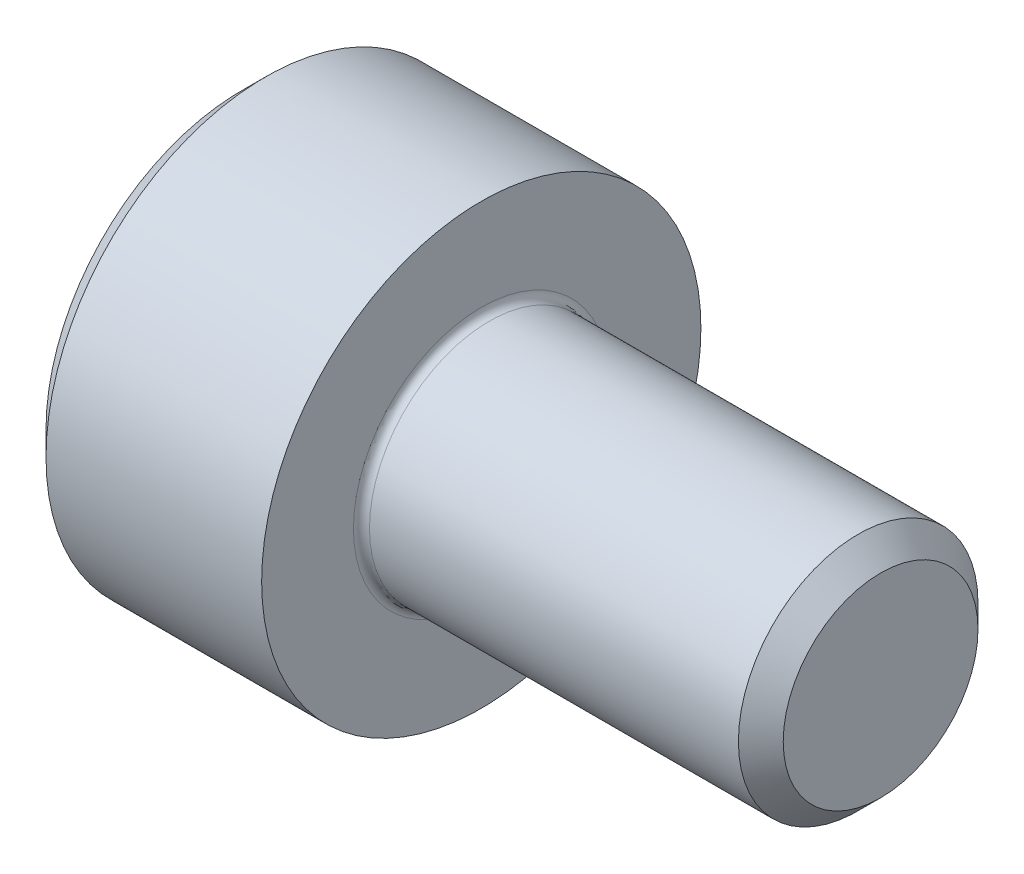
ISO-10303-21;
HEADER;
FILE_DESCRIPTION(('STEP AP214'),'2;1');
FILE_NAME('part.step','',(''),(''),'','','');
FILE_SCHEMA(('AUTOMOTIVE_DESIGN { 1 0 10303 214 1 1 1 1 }'));
ENDSEC;
DATA;
#1=APPLICATION_CONTEXT('core data for automotive mechanical design processes');
#2=APPLICATION_PROTOCOL_DEFINITION('international standard','automotive_design',2000,#1);
#3=PRODUCT_CONTEXT('',#1,'mechanical');
#4=PRODUCT('Part','Part','',(#3));
#5=PRODUCT_RELATED_PRODUCT_CATEGORY('part','',(#4));
#6=PRODUCT_DEFINITION_FORMATION('','',#4);
#7=PRODUCT_DEFINITION_CONTEXT('part definition',#1,'design');
#8=PRODUCT_DEFINITION('design','',#6,#7);
#9=PRODUCT_DEFINITION_SHAPE('','',#8);
#10=(LENGTH_UNIT() NAMED_UNIT(*) SI_UNIT(.MILLI.,.METRE.));
#11=(NAMED_UNIT(*) PLANE_ANGLE_UNIT() SI_UNIT($,.RADIAN.));
#12=(NAMED_UNIT(*) SI_UNIT($,.STERADIAN.) SOLID_ANGLE_UNIT());
#13=UNCERTAINTY_MEASURE_WITH_UNIT(LENGTH_MEASURE(1.E-05),#10,'distance_accuracy_value','');
#14=(GEOMETRIC_REPRESENTATION_CONTEXT(3) GLOBAL_UNCERTAINTY_ASSIGNED_CONTEXT((#13)) GLOBAL_UNIT_ASSIGNED_CONTEXT((#10,
#11,#12)) REPRESENTATION_CONTEXT('',''));
#15=CARTESIAN_POINT('',(0.,0.,0.));
#16=DIRECTION('',(0.,0.,1.));
#17=DIRECTION('',(1.,0.,0.));
#18=AXIS2_PLACEMENT_3D('',#15,#16,#17);
#19=CARTESIAN_POINT('',(0.,0.,0.));
#20=DIRECTION('',(-1.,0.,0.));
#21=DIRECTION('',(0.,0.,1.));
#22=AXIS2_PLACEMENT_3D('',#19,#20,#21);
#23=PLANE('',#22);
#24=DIRECTION('',(0.,-0.499999999999998,0.86602540378444));
#25=VECTOR('',#24,1.);
#26=CARTESIAN_POINT('',(0.,1.47801668912544,0.));
#27=LINE('',#26,#25);
#28=CARTESIAN_POINT('',(0.,1.47801668912544,0.));
#29=VERTEX_POINT('',#28);
#30=CARTESIAN_POINT('',(0.,0.73900834456272,1.28));
#31=VERTEX_POINT('',#30);
#32=EDGE_CURVE('E351',#29,#31,#27,.T.);
#33=ORIENTED_EDGE('',*,*,#32,.T.);
#34=DIRECTION('',(0.,1.,0.));
#35=VECTOR('',#34,1.);
#36=CARTESIAN_POINT('',(0.,-0.739008344562723,1.28));
#37=LINE('',#36,#35);
#38=CARTESIAN_POINT('',(0.,-0.739008344562723,1.28));
#39=VERTEX_POINT('',#38);
#40=EDGE_CURVE('E139',#39,#31,#37,.T.);
#41=ORIENTED_EDGE('',*,*,#40,.F.);
#42=DIRECTION('',(0.,-0.500000000000001,-0.866025403784438));
#43=VECTOR('',#42,1.);
#44=CARTESIAN_POINT('',(0.,-0.739008344562723,1.28));
#45=LINE('',#44,#43);
#46=CARTESIAN_POINT('',(0.,-1.47801668912545,0.));
#47=VERTEX_POINT('',#46);
#48=EDGE_CURVE('E354',#39,#47,#45,.T.);
#49=ORIENTED_EDGE('',*,*,#48,.T.);
#50=DIRECTION('',(0.,0.499999999999998,-0.866025403784439));
#51=VECTOR('',#50,1.);
#52=CARTESIAN_POINT('',(0.,-1.47801668912545,0.));
#53=LINE('',#52,#51);
#54=CARTESIAN_POINT('',(0.,-0.739008344562727,-1.28));
#55=VERTEX_POINT('',#54);
#56=EDGE_CURVE('E357',#47,#55,#53,.T.);
#57=ORIENTED_EDGE('',*,*,#56,.T.);
#58=DIRECTION('',(0.,-1.,0.));
#59=VECTOR('',#58,1.);
#60=CARTESIAN_POINT('',(0.,0.739008344562715,-1.28));
#61=LINE('',#60,#59);
#62=CARTESIAN_POINT('',(0.,0.739008344562715,-1.28));
#63=VERTEX_POINT('',#62);
#64=EDGE_CURVE('E360',#63,#55,#61,.T.);
#65=ORIENTED_EDGE('',*,*,#64,.F.);
#66=DIRECTION('',(0.,-0.500000000000001,-0.866025403784438));
#67=VECTOR('',#66,1.);
#68=CARTESIAN_POINT('',(0.,1.47801668912544,0.));
#69=LINE('',#68,#67);
#70=EDGE_CURVE('E134',#29,#63,#69,.T.);
#71=ORIENTED_EDGE('',*,*,#70,.F.);
#72=EDGE_LOOP('',(#33,#41,#49,#57,#65,#71));
#73=FACE_BOUND('',#72,.T.);
#74=CARTESIAN_POINT('',(0.,0.,0.));
#75=DIRECTION('',(-1.,0.,0.));
#76=DIRECTION('',(0.,0.,1.));
#77=AXIS2_PLACEMENT_3D('',#74,#75,#76);
#78=CIRCLE('',#77,2.45);
#79=CARTESIAN_POINT('',(0.,0.,2.45));
#80=VERTEX_POINT('',#79);
#81=EDGE_CURVE('E150',#80,#80,#78,.T.);
#82=ORIENTED_EDGE('',*,*,#81,.T.);
#83=EDGE_LOOP('',(#82));
#84=FACE_BOUND('',#83,.T.);
#85=ADVANCED_FACE('F43',(#73,#84),#23,.T.);
#86=CARTESIAN_POINT('',(8.,1.2195,0.));
#87=DIRECTION('',(1.,0.,0.));
#88=DIRECTION('',(0.,0.,-1.));
#89=AXIS2_PLACEMENT_3D('',#86,#87,#88);
#90=PLANE('',#89);
#91=CARTESIAN_POINT('',(8.,0.,0.));
#92=DIRECTION('',(-1.,0.,0.));
#93=DIRECTION('',(0.,0.,1.));
#94=AXIS2_PLACEMENT_3D('',#91,#92,#93);
#95=CIRCLE('',#94,1.2195);
#96=CARTESIAN_POINT('',(8.,0.,1.2195));
#97=VERTEX_POINT('',#96);
#98=EDGE_CURVE('E163',#97,#97,#95,.T.);
#99=ORIENTED_EDGE('',*,*,#98,.F.);
#100=EDGE_LOOP('',(#99));
#101=FACE_BOUND('',#100,.T.);
#102=ADVANCED_FACE('F185',(#101),#90,.T.);
#103=CARTESIAN_POINT('',(8.,0.,0.));
#104=DIRECTION('',(-1.,0.,0.));
#105=DIRECTION('',(0.,0.,1.));
#106=AXIS2_PLACEMENT_3D('',#103,#104,#105);
#107=CONICAL_SURFACE('',#106,1.2195,0.785398163397091);
#108=CARTESIAN_POINT('',(7.71949999999991,0.,0.));
#109=DIRECTION('',(-1.,0.,0.));
#110=DIRECTION('',(0.,0.,1.));
#111=AXIS2_PLACEMENT_3D('',#108,#109,#110);
#112=CIRCLE('',#111,1.49999999999989);
#113=CARTESIAN_POINT('',(7.71949999999991,0.,1.49999999999989));
#114=VERTEX_POINT('',#113);
#115=EDGE_CURVE('E160',#114,#114,#112,.T.);
#116=ORIENTED_EDGE('',*,*,#115,.F.);
#117=EDGE_LOOP('',(#116));
#118=FACE_BOUND('',#117,.T.);
#119=ORIENTED_EDGE('',*,*,#98,.T.);
#120=EDGE_LOOP('',(#119));
#121=FACE_BOUND('',#120,.T.);
#122=ADVANCED_FACE('F191',(#118,#121),#107,.T.);
#123=CARTESIAN_POINT('',(-31.75,0.,0.));
#124=DIRECTION('',(-1.,0.,0.));
#125=DIRECTION('',(0.,0.,1.));
#126=AXIS2_PLACEMENT_3D('',#123,#124,#125);
#127=CYLINDRICAL_SURFACE('',#126,1.49999999999995);
#128=CARTESIAN_POINT('',(3.1,0.,0.));
#129=DIRECTION('',(1.,0.,0.));
#130=DIRECTION('',(0.,0.,-1.));
#131=AXIS2_PLACEMENT_3D('',#128,#129,#130);
#132=CIRCLE('',#131,1.49999999999995);
#133=CARTESIAN_POINT('',(3.1,0.,-1.49999999999995));
#134=VERTEX_POINT('',#133);
#135=EDGE_CURVE('E11',#134,#134,#132,.T.);
#136=ORIENTED_EDGE('',*,*,#135,.T.);
#137=EDGE_LOOP('',(#136));
#138=FACE_BOUND('',#137,.T.);
#139=ORIENTED_EDGE('',*,*,#115,.T.);
#140=EDGE_LOOP('',(#139));
#141=FACE_BOUND('',#140,.T.);
#142=ADVANCED_FACE('F201',(#138,#141),#127,.T.);
#143=CARTESIAN_POINT('',(3.,2.75,0.));
#144=DIRECTION('',(1.,0.,0.));
#145=DIRECTION('',(0.,0.,-1.));
#146=AXIS2_PLACEMENT_3D('',#143,#144,#145);
#147=PLANE('',#146);
#148=CARTESIAN_POINT('',(3.,0.,0.));
#149=DIRECTION('',(1.,0.,0.));
#150=DIRECTION('',(0.,0.,-1.));
#151=AXIS2_PLACEMENT_3D('',#148,#149,#150);
#152=CIRCLE('',#151,1.59999999999995);
#153=CARTESIAN_POINT('',(3.,0.,-1.59999999999995));
#154=VERTEX_POINT('',#153);
#155=EDGE_CURVE('E51',#154,#154,#152,.F.);
#156=ORIENTED_EDGE('',*,*,#155,.T.);
#157=EDGE_LOOP('',(#156));
#158=FACE_BOUND('',#157,.T.);
#159=CARTESIAN_POINT('',(3.,0.,0.));
#160=DIRECTION('',(-1.,0.,0.));
#161=DIRECTION('',(0.,0.,1.));
#162=AXIS2_PLACEMENT_3D('',#159,#160,#161);
#163=CIRCLE('',#162,2.75);
#164=CARTESIAN_POINT('',(3.,0.,2.75));
#165=VERTEX_POINT('',#164);
#166=EDGE_CURVE('E157',#165,#165,#163,.T.);
#167=ORIENTED_EDGE('',*,*,#166,.F.);
#168=EDGE_LOOP('',(#167));
#169=FACE_BOUND('',#168,.T.);
#170=ADVANCED_FACE('F168',(#158,#169),#147,.T.);
#171=CARTESIAN_POINT('',(-31.75,0.,0.));
#172=DIRECTION('',(-1.,0.,0.));
#173=DIRECTION('',(0.,0.,1.));
#174=AXIS2_PLACEMENT_3D('',#171,#172,#173);
#175=CYLINDRICAL_SURFACE('',#174,2.75);
#176=ORIENTED_EDGE('',*,*,#166,.T.);
#177=EDGE_LOOP('',(#176));
#178=FACE_BOUND('',#177,.T.);
#179=CARTESIAN_POINT('',(0.300000000000002,0.,0.));
#180=DIRECTION('',(-1.,0.,0.));
#181=DIRECTION('',(0.,0.,1.));
#182=AXIS2_PLACEMENT_3D('',#179,#180,#181);
#183=CIRCLE('',#182,2.75);
#184=CARTESIAN_POINT('',(0.300000000000002,0.,2.75));
#185=VERTEX_POINT('',#184);
#186=EDGE_CURVE('E154',#185,#185,#183,.T.);
#187=ORIENTED_EDGE('',*,*,#186,.F.);
#188=EDGE_LOOP('',(#187));
#189=FACE_BOUND('',#188,.T.);
#190=ADVANCED_FACE('F181',(#178,#189),#175,.T.);
#191=CARTESIAN_POINT('',(0.,0.,0.));
#192=DIRECTION('',(1.,0.,0.));
#193=DIRECTION('',(0.,0.,-1.));
#194=AXIS2_PLACEMENT_3D('',#191,#192,#193);
#195=CONICAL_SURFACE('',#194,2.45,0.785398163397441);
#196=ORIENTED_EDGE('',*,*,#186,.T.);
#197=EDGE_LOOP('',(#196));
#198=FACE_BOUND('',#197,.T.);
#199=ORIENTED_EDGE('',*,*,#81,.F.);
#200=EDGE_LOOP('',(#199));
#201=FACE_BOUND('',#200,.T.);
#202=ADVANCED_FACE('F172',(#198,#201),#195,.T.);
#203=CARTESIAN_POINT('',(3.1,0.,0.));
#204=DIRECTION('',(1.,0.,0.));
#205=DIRECTION('',(0.,0.,-1.));
#206=AXIS2_PLACEMENT_3D('',#203,#204,#205);
#207=TOROIDAL_SURFACE('',#206,1.59999999999995,0.1);
#208=ORIENTED_EDGE('',*,*,#135,.F.);
#209=EDGE_LOOP('',(#208));
#210=FACE_BOUND('',#209,.T.);
#211=ORIENTED_EDGE('',*,*,#155,.F.);
#212=EDGE_LOOP('',(#211));
#213=FACE_BOUND('',#212,.T.);
#214=ADVANCED_FACE('F45',(#210,#213),#207,.F.);
#215=CARTESIAN_POINT('',(1.3,1.47801668912544,0.));
#216=DIRECTION('',(0.,-0.86602540378444,-0.499999999999998));
#217=DIRECTION('',(0.,0.499999999999998,-0.86602540378444));
#218=AXIS2_PLACEMENT_3D('',#215,#216,#217);
#219=PLANE('',#218);
#220=ORIENTED_EDGE('',*,*,#32,.F.);
#221=DIRECTION('',(-1.,0.,0.));
#222=VECTOR('',#221,1.);
#223=CARTESIAN_POINT('',(1.3,1.47801668912544,0.));
#224=LINE('',#223,#222);
#225=CARTESIAN_POINT('',(1.3,1.47801668912544,0.));
#226=VERTEX_POINT('',#225);
#227=EDGE_CURVE('E341',#226,#29,#224,.T.);
#228=ORIENTED_EDGE('',*,*,#227,.F.);
#229=DIRECTION('',(0.,-0.499999999999998,0.86602540378444));
#230=VECTOR('',#229,1.);
#231=CARTESIAN_POINT('',(1.3,1.47801668912544,0.));
#232=LINE('',#231,#230);
#233=CARTESIAN_POINT('',(1.3,1.10851251684408,0.639999999999996));
#234=VERTEX_POINT('',#233);
#235=EDGE_CURVE('E126',#226,#234,#232,.T.);
#236=ORIENTED_EDGE('',*,*,#235,.T.);
#237=CARTESIAN_POINT('',(1.3,0.73900834456272,1.28));
#238=VERTEX_POINT('',#237);
#239=EDGE_CURVE('E117',#234,#238,#232,.T.);
#240=ORIENTED_EDGE('',*,*,#239,.T.);
#241=DIRECTION('',(-1.,0.,0.));
#242=VECTOR('',#241,1.);
#243=CARTESIAN_POINT('',(1.3,0.73900834456272,1.28));
#244=LINE('',#243,#242);
#245=EDGE_CURVE('E131',#238,#31,#244,.T.);
#246=ORIENTED_EDGE('',*,*,#245,.T.);
#247=EDGE_LOOP('',(#220,#228,#236,#240,#246));
#248=FACE_BOUND('',#247,.T.);
#249=ADVANCED_FACE('F130',(#248),#219,.T.);
#250=CARTESIAN_POINT('',(1.3,-0.739008344562723,1.28));
#251=DIRECTION('',(0.,0.,1.));
#252=DIRECTION('',(0.,-1.,0.));
#253=AXIS2_PLACEMENT_3D('',#250,#251,#252);
#254=PLANE('',#253);
#255=ORIENTED_EDGE('',*,*,#40,.T.);
#256=ORIENTED_EDGE('',*,*,#245,.F.);
#257=DIRECTION('',(0.,1.,0.));
#258=VECTOR('',#257,1.);
#259=CARTESIAN_POINT('',(1.3,-0.739008344562723,1.28));
#260=LINE('',#259,#258);
#261=CARTESIAN_POINT('',(1.3,0.,1.28));
#262=VERTEX_POINT('',#261);
#263=EDGE_CURVE('E114',#262,#238,#260,.T.);
#264=ORIENTED_EDGE('',*,*,#263,.F.);
#265=CARTESIAN_POINT('',(1.3,-0.739008344562723,1.28));
#266=VERTEX_POINT('',#265);
#267=EDGE_CURVE('E125',#266,#262,#260,.T.);
#268=ORIENTED_EDGE('',*,*,#267,.F.);
#269=DIRECTION('',(-1.,0.,0.));
#270=VECTOR('',#269,1.);
#271=CARTESIAN_POINT('',(1.3,-0.739008344562723,1.28));
#272=LINE('',#271,#270);
#273=EDGE_CURVE('E141',#266,#39,#272,.T.);
#274=ORIENTED_EDGE('',*,*,#273,.T.);
#275=EDGE_LOOP('',(#255,#256,#264,#268,#274));
#276=FACE_BOUND('',#275,.T.);
#277=ADVANCED_FACE('F136',(#276),#254,.F.);
#278=CARTESIAN_POINT('',(1.3,-0.739008344562723,1.28));
#279=DIRECTION('',(0.,0.866025403784438,-0.500000000000001));
#280=DIRECTION('',(0.,0.500000000000001,0.866025403784438));
#281=AXIS2_PLACEMENT_3D('',#278,#279,#280);
#282=PLANE('',#281);
#283=ORIENTED_EDGE('',*,*,#48,.F.);
#284=ORIENTED_EDGE('',*,*,#273,.F.);
#285=DIRECTION('',(0.,-0.500000000000001,-0.866025403784438));
#286=VECTOR('',#285,1.);
#287=CARTESIAN_POINT('',(1.3,-0.739008344562723,1.28));
#288=LINE('',#287,#286);
#289=CARTESIAN_POINT('',(1.3,-1.10851251684408,0.640000000000003));
#290=VERTEX_POINT('',#289);
#291=EDGE_CURVE('E380',#266,#290,#288,.T.);
#292=ORIENTED_EDGE('',*,*,#291,.T.);
#293=CARTESIAN_POINT('',(1.3,-1.47801668912545,0.));
#294=VERTEX_POINT('',#293);
#295=EDGE_CURVE('E369',#290,#294,#288,.T.);
#296=ORIENTED_EDGE('',*,*,#295,.T.);
#297=DIRECTION('',(-1.,0.,0.));
#298=VECTOR('',#297,1.);
#299=CARTESIAN_POINT('',(1.3,-1.47801668912545,0.));
#300=LINE('',#299,#298);
#301=EDGE_CURVE('E146',#294,#47,#300,.T.);
#302=ORIENTED_EDGE('',*,*,#301,.T.);
#303=EDGE_LOOP('',(#283,#284,#292,#296,#302));
#304=FACE_BOUND('',#303,.T.);
#305=ADVANCED_FACE('F255',(#304),#282,.T.);
#306=CARTESIAN_POINT('',(1.3,-1.47801668912545,0.));
#307=DIRECTION('',(0.,0.86602540378444,0.499999999999998));
#308=DIRECTION('',(0.,-0.499999999999998,0.86602540378444));
#309=AXIS2_PLACEMENT_3D('',#306,#307,#308);
#310=PLANE('',#309);
#311=ORIENTED_EDGE('',*,*,#56,.F.);
#312=ORIENTED_EDGE('',*,*,#301,.F.);
#313=DIRECTION('',(0.,0.499999999999998,-0.866025403784439));
#314=VECTOR('',#313,1.);
#315=CARTESIAN_POINT('',(1.3,-1.47801668912545,0.));
#316=LINE('',#315,#314);
#317=CARTESIAN_POINT('',(1.3,-1.10851251684409,-0.64));
#318=VERTEX_POINT('',#317);
#319=EDGE_CURVE('E347',#294,#318,#316,.T.);
#320=ORIENTED_EDGE('',*,*,#319,.T.);
#321=CARTESIAN_POINT('',(1.3,-0.739008344562727,-1.28));
#322=VERTEX_POINT('',#321);
#323=EDGE_CURVE('E379',#318,#322,#316,.T.);
#324=ORIENTED_EDGE('',*,*,#323,.T.);
#325=DIRECTION('',(-1.,0.,0.));
#326=VECTOR('',#325,1.);
#327=CARTESIAN_POINT('',(1.3,-0.739008344562727,-1.28));
#328=LINE('',#327,#326);
#329=EDGE_CURVE('E340',#322,#55,#328,.T.);
#330=ORIENTED_EDGE('',*,*,#329,.T.);
#331=EDGE_LOOP('',(#311,#312,#320,#324,#330));
#332=FACE_BOUND('',#331,.T.);
#333=ADVANCED_FACE('F262',(#332),#310,.T.);
#334=CARTESIAN_POINT('',(1.3,0.739008344562715,-1.28));
#335=DIRECTION('',(0.,0.,-1.));
#336=DIRECTION('',(0.,1.,0.));
#337=AXIS2_PLACEMENT_3D('',#334,#335,#336);
#338=PLANE('',#337);
#339=ORIENTED_EDGE('',*,*,#64,.T.);
#340=ORIENTED_EDGE('',*,*,#329,.F.);
#341=DIRECTION('',(0.,-1.,0.));
#342=VECTOR('',#341,1.);
#343=CARTESIAN_POINT('',(1.3,0.739008344562715,-1.28));
#344=LINE('',#343,#342);
#345=CARTESIAN_POINT('',(1.3,0.,-1.28));
#346=VERTEX_POINT('',#345);
#347=EDGE_CURVE('E344',#346,#322,#344,.T.);
#348=ORIENTED_EDGE('',*,*,#347,.F.);
#349=CARTESIAN_POINT('',(1.3,0.739008344562715,-1.28));
#350=VERTEX_POINT('',#349);
#351=EDGE_CURVE('E58',#350,#346,#344,.T.);
#352=ORIENTED_EDGE('',*,*,#351,.F.);
#353=DIRECTION('',(-1.,0.,0.));
#354=VECTOR('',#353,1.);
#355=CARTESIAN_POINT('',(1.3,0.739008344562715,-1.28));
#356=LINE('',#355,#354);
#357=EDGE_CURVE('E337',#350,#63,#356,.T.);
#358=ORIENTED_EDGE('',*,*,#357,.T.);
#359=EDGE_LOOP('',(#339,#340,#348,#352,#358));
#360=FACE_BOUND('',#359,.T.);
#361=ADVANCED_FACE('F270',(#360),#338,.F.);
#362=CARTESIAN_POINT('',(1.3,1.47801668912544,0.));
#363=DIRECTION('',(0.,0.866025403784438,-0.500000000000001));
#364=DIRECTION('',(0.,0.500000000000001,0.866025403784438));
#365=AXIS2_PLACEMENT_3D('',#362,#363,#364);
#366=PLANE('',#365);
#367=ORIENTED_EDGE('',*,*,#70,.T.);
#368=ORIENTED_EDGE('',*,*,#357,.F.);
#369=DIRECTION('',(0.,-0.500000000000001,-0.866025403784438));
#370=VECTOR('',#369,1.);
#371=CARTESIAN_POINT('',(1.3,1.47801668912544,0.));
#372=LINE('',#371,#370);
#373=CARTESIAN_POINT('',(1.3,1.10851251684408,-0.64));
#374=VERTEX_POINT('',#373);
#375=EDGE_CURVE('E327',#374,#350,#372,.T.);
#376=ORIENTED_EDGE('',*,*,#375,.F.);
#377=EDGE_CURVE('E333',#226,#374,#372,.T.);
#378=ORIENTED_EDGE('',*,*,#377,.F.);
#379=ORIENTED_EDGE('',*,*,#227,.T.);
#380=EDGE_LOOP('',(#367,#368,#376,#378,#379));
#381=FACE_BOUND('',#380,.T.);
#382=ADVANCED_FACE('F278',(#381),#366,.F.);
#383=CARTESIAN_POINT('',(1.3,2.21702503368816,-1.28000000000001));
#384=DIRECTION('',(1.,0.,0.));
#385=DIRECTION('',(0.,0.,-1.));
#386=AXIS2_PLACEMENT_3D('',#383,#384,#385);
#387=PLANE('',#386);
#388=ORIENTED_EDGE('',*,*,#347,.T.);
#389=ORIENTED_EDGE('',*,*,#323,.F.);
#390=CARTESIAN_POINT('',(1.3,0.,0.));
#391=DIRECTION('',(-1.,0.,0.));
#392=DIRECTION('',(0.,0.,1.));
#393=AXIS2_PLACEMENT_3D('',#390,#391,#392);
#394=CIRCLE('',#393,1.28);
#395=EDGE_CURVE('E375',#346,#318,#394,.T.);
#396=ORIENTED_EDGE('',*,*,#395,.F.);
#397=EDGE_LOOP('',(#388,#389,#396));
#398=FACE_BOUND('',#397,.T.);
#399=ADVANCED_FACE('F286',(#398),#387,.F.);
#400=ORIENTED_EDGE('',*,*,#319,.F.);
#401=ORIENTED_EDGE('',*,*,#295,.F.);
#402=EDGE_CURVE('E144',#318,#290,#394,.T.);
#403=ORIENTED_EDGE('',*,*,#402,.F.);
#404=EDGE_LOOP('',(#400,#401,#403));
#405=FACE_BOUND('',#404,.T.);
#406=ADVANCED_FACE('F294',(#405),#387,.F.);
#407=ORIENTED_EDGE('',*,*,#291,.F.);
#408=ORIENTED_EDGE('',*,*,#267,.T.);
#409=EDGE_CURVE('E140',#290,#262,#394,.T.);
#410=ORIENTED_EDGE('',*,*,#409,.F.);
#411=EDGE_LOOP('',(#407,#408,#410));
#412=FACE_BOUND('',#411,.T.);
#413=ADVANCED_FACE('F302',(#412),#387,.F.);
#414=ORIENTED_EDGE('',*,*,#263,.T.);
#415=ORIENTED_EDGE('',*,*,#239,.F.);
#416=EDGE_CURVE('E120',#262,#234,#394,.T.);
#417=ORIENTED_EDGE('',*,*,#416,.F.);
#418=EDGE_LOOP('',(#414,#415,#417));
#419=FACE_BOUND('',#418,.T.);
#420=ADVANCED_FACE('F116',(#419),#387,.F.);
#421=ORIENTED_EDGE('',*,*,#235,.F.);
#422=ORIENTED_EDGE('',*,*,#377,.T.);
#423=EDGE_CURVE('E151',#234,#374,#394,.T.);
#424=ORIENTED_EDGE('',*,*,#423,.F.);
#425=EDGE_LOOP('',(#421,#422,#424));
#426=FACE_BOUND('',#425,.T.);
#427=ADVANCED_FACE('F315',(#426),#387,.F.);
#428=ORIENTED_EDGE('',*,*,#375,.T.);
#429=ORIENTED_EDGE('',*,*,#351,.T.);
#430=EDGE_CURVE('E330',#374,#346,#394,.T.);
#431=ORIENTED_EDGE('',*,*,#430,.F.);
#432=EDGE_LOOP('',(#428,#429,#431));
#433=FACE_BOUND('',#432,.T.);
#434=ADVANCED_FACE('F241',(#433),#387,.F.);
#435=CARTESIAN_POINT('',(1.3,0.,0.));
#436=DIRECTION('',(-1.,0.,0.));
#437=DIRECTION('',(0.,0.,1.));
#438=AXIS2_PLACEMENT_3D('',#435,#436,#437);
#439=CONICAL_SURFACE('',#438,1.28,1.0471975511966);
#440=CARTESIAN_POINT('',(2.03900834456273,0.,0.));
#441=VERTEX_POINT('',#440);
#442=VERTEX_LOOP('',#441);
#443=FACE_BOUND('',#442,.T.);
#444=ORIENTED_EDGE('',*,*,#416,.T.);
#445=ORIENTED_EDGE('',*,*,#423,.T.);
#446=ORIENTED_EDGE('',*,*,#430,.T.);
#447=ORIENTED_EDGE('',*,*,#395,.T.);
#448=ORIENTED_EDGE('',*,*,#402,.T.);
#449=ORIENTED_EDGE('',*,*,#409,.T.);
#450=EDGE_LOOP('',(#444,#445,#446,#447,#448,#449));
#451=FACE_BOUND('',#450,.T.);
#452=ADVANCED_FACE('F195',(#443,#451),#439,.F.);
#453=CLOSED_SHELL('',(#85,#102,#122,#142,#170,#190,#202,#214,#249,#277,#305,#333,#361,#382,#399,
#406,#413,#420,#427,#434,#452));
#454=MANIFOLD_SOLID_BREP('B2',#453);
#455=ADVANCED_BREP_SHAPE_REPRESENTATION('',(#18,#454),#14);
#456=SHAPE_DEFINITION_REPRESENTATION(#9,#455);
ENDSEC;
END-ISO-10303-21;
